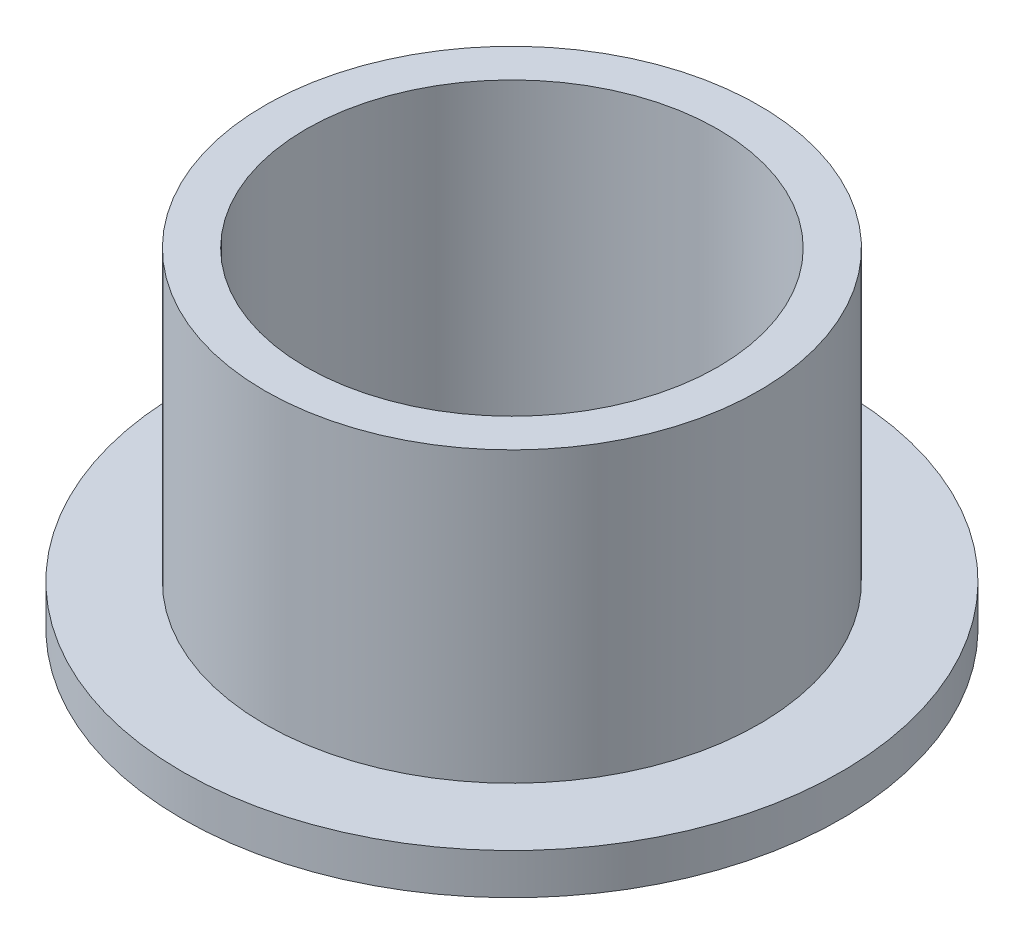
ISO-10303-21;
HEADER;
FILE_DESCRIPTION(('STEP AP214'),'2;1');
FILE_NAME('part.step','',(''),(''),'','','');
FILE_SCHEMA(('AUTOMOTIVE_DESIGN { 1 0 10303 214 1 1 1 1 }'));
ENDSEC;
DATA;
#1=APPLICATION_CONTEXT('core data for automotive mechanical design processes');
#2=APPLICATION_PROTOCOL_DEFINITION('international standard','automotive_design',2000,#1);
#3=PRODUCT_CONTEXT('',#1,'mechanical');
#4=PRODUCT('Part','Part','',(#3));
#5=PRODUCT_RELATED_PRODUCT_CATEGORY('part','',(#4));
#6=PRODUCT_DEFINITION_FORMATION('','',#4);
#7=PRODUCT_DEFINITION_CONTEXT('part definition',#1,'design');
#8=PRODUCT_DEFINITION('design','',#6,#7);
#9=PRODUCT_DEFINITION_SHAPE('','',#8);
#10=(LENGTH_UNIT() NAMED_UNIT(*) SI_UNIT(.MILLI.,.METRE.));
#11=(NAMED_UNIT(*) PLANE_ANGLE_UNIT() SI_UNIT($,.RADIAN.));
#12=(NAMED_UNIT(*) SI_UNIT($,.STERADIAN.) SOLID_ANGLE_UNIT());
#13=UNCERTAINTY_MEASURE_WITH_UNIT(LENGTH_MEASURE(1.E-05),#10,'distance_accuracy_value','');
#14=(GEOMETRIC_REPRESENTATION_CONTEXT(3) GLOBAL_UNCERTAINTY_ASSIGNED_CONTEXT((#13)) GLOBAL_UNIT_ASSIGNED_CONTEXT((#10,
#11,#12)) REPRESENTATION_CONTEXT('',''));
#15=CARTESIAN_POINT('',(0.,0.,0.));
#16=DIRECTION('',(0.,0.,1.));
#17=DIRECTION('',(1.,0.,0.));
#18=AXIS2_PLACEMENT_3D('',#15,#16,#17);
#19=CARTESIAN_POINT('',(0.,26.7127403846154,0.));
#20=DIRECTION('',(0.,1.,0.));
#21=DIRECTION('',(0.,0.,1.));
#22=AXIS2_PLACEMENT_3D('',#19,#20,#21);
#23=CYLINDRICAL_SURFACE('',#22,7.9375);
#24=CARTESIAN_POINT('',(0.,0.,0.));
#25=DIRECTION('',(0.,1.,0.));
#26=DIRECTION('',(0.,0.,1.));
#27=AXIS2_PLACEMENT_3D('',#24,#25,#26);
#28=CIRCLE('',#27,7.9375);
#29=CARTESIAN_POINT('',(0.,0.,7.9375));
#30=VERTEX_POINT('',#29);
#31=EDGE_CURVE('E10',#30,#30,#28,.T.);
#32=ORIENTED_EDGE('',*,*,#31,.F.);
#33=EDGE_LOOP('',(#32));
#34=FACE_BOUND('',#33,.T.);
#35=CARTESIAN_POINT('',(0.,12.7,0.));
#36=DIRECTION('',(0.,1.,0.));
#37=DIRECTION('',(0.,0.,1.));
#38=AXIS2_PLACEMENT_3D('',#35,#36,#37);
#39=CIRCLE('',#38,7.9375);
#40=CARTESIAN_POINT('',(0.,12.7,7.9375));
#41=VERTEX_POINT('',#40);
#42=EDGE_CURVE('E54',#41,#41,#39,.T.);
#43=ORIENTED_EDGE('',*,*,#42,.T.);
#44=EDGE_LOOP('',(#43));
#45=FACE_BOUND('',#44,.T.);
#46=ADVANCED_FACE('F32',(#34,#45),#23,.F.);
#47=CARTESIAN_POINT('',(7.9375,0.,0.));
#48=DIRECTION('',(0.,1.,0.));
#49=DIRECTION('',(0.,0.,1.));
#50=AXIS2_PLACEMENT_3D('',#47,#48,#49);
#51=PLANE('',#50);
#52=CARTESIAN_POINT('',(0.,0.,0.));
#53=DIRECTION('',(0.,1.,0.));
#54=DIRECTION('',(0.,0.,1.));
#55=AXIS2_PLACEMENT_3D('',#52,#53,#54);
#56=CIRCLE('',#55,12.7);
#57=CARTESIAN_POINT('',(0.,0.,12.7));
#58=VERTEX_POINT('',#57);
#59=EDGE_CURVE('E38',#58,#58,#56,.T.);
#60=ORIENTED_EDGE('',*,*,#59,.F.);
#61=EDGE_LOOP('',(#60));
#62=FACE_BOUND('',#61,.T.);
#63=ORIENTED_EDGE('',*,*,#31,.T.);
#64=EDGE_LOOP('',(#63));
#65=FACE_BOUND('',#64,.T.);
#66=ADVANCED_FACE('F79',(#62,#65),#51,.F.);
#67=CARTESIAN_POINT('',(0.,26.7127403846154,0.));
#68=DIRECTION('',(0.,1.,0.));
#69=DIRECTION('',(0.,0.,1.));
#70=AXIS2_PLACEMENT_3D('',#67,#68,#69);
#71=CYLINDRICAL_SURFACE('',#70,12.7);
#72=CARTESIAN_POINT('',(0.,1.5748,0.));
#73=DIRECTION('',(0.,1.,0.));
#74=DIRECTION('',(0.,0.,1.));
#75=AXIS2_PLACEMENT_3D('',#72,#73,#74);
#76=CIRCLE('',#75,12.7);
#77=CARTESIAN_POINT('',(0.,1.5748,12.7));
#78=VERTEX_POINT('',#77);
#79=EDGE_CURVE('E42',#78,#78,#76,.T.);
#80=ORIENTED_EDGE('',*,*,#79,.F.);
#81=EDGE_LOOP('',(#80));
#82=FACE_BOUND('',#81,.T.);
#83=ORIENTED_EDGE('',*,*,#59,.T.);
#84=EDGE_LOOP('',(#83));
#85=FACE_BOUND('',#84,.T.);
#86=ADVANCED_FACE('F74',(#82,#85),#71,.T.);
#87=CARTESIAN_POINT('',(12.7,1.5748,0.));
#88=DIRECTION('',(0.,-1.,0.));
#89=DIRECTION('',(0.,0.,-1.));
#90=AXIS2_PLACEMENT_3D('',#87,#88,#89);
#91=PLANE('',#90);
#92=CARTESIAN_POINT('',(0.,1.5748,0.));
#93=DIRECTION('',(0.,1.,0.));
#94=DIRECTION('',(0.,0.,1.));
#95=AXIS2_PLACEMENT_3D('',#92,#93,#94);
#96=CIRCLE('',#95,9.525);
#97=CARTESIAN_POINT('',(0.,1.5748,9.525));
#98=VERTEX_POINT('',#97);
#99=EDGE_CURVE('E46',#98,#98,#96,.T.);
#100=ORIENTED_EDGE('',*,*,#99,.F.);
#101=EDGE_LOOP('',(#100));
#102=FACE_BOUND('',#101,.T.);
#103=ORIENTED_EDGE('',*,*,#79,.T.);
#104=EDGE_LOOP('',(#103));
#105=FACE_BOUND('',#104,.T.);
#106=ADVANCED_FACE('F68',(#102,#105),#91,.F.);
#107=CARTESIAN_POINT('',(0.,26.7127403846154,0.));
#108=DIRECTION('',(0.,1.,0.));
#109=DIRECTION('',(0.,0.,1.));
#110=AXIS2_PLACEMENT_3D('',#107,#108,#109);
#111=CYLINDRICAL_SURFACE('',#110,9.525);
#112=CARTESIAN_POINT('',(0.,12.7,0.));
#113=DIRECTION('',(0.,1.,0.));
#114=DIRECTION('',(0.,0.,1.));
#115=AXIS2_PLACEMENT_3D('',#112,#113,#114);
#116=CIRCLE('',#115,9.525);
#117=CARTESIAN_POINT('',(0.,12.7,9.525));
#118=VERTEX_POINT('',#117);
#119=EDGE_CURVE('E51',#118,#118,#116,.T.);
#120=ORIENTED_EDGE('',*,*,#119,.F.);
#121=EDGE_LOOP('',(#120));
#122=FACE_BOUND('',#121,.T.);
#123=ORIENTED_EDGE('',*,*,#99,.T.);
#124=EDGE_LOOP('',(#123));
#125=FACE_BOUND('',#124,.T.);
#126=ADVANCED_FACE('F62',(#122,#125),#111,.T.);
#127=CARTESIAN_POINT('',(9.525,12.7,0.));
#128=DIRECTION('',(0.,-1.,0.));
#129=DIRECTION('',(0.,0.,-1.));
#130=AXIS2_PLACEMENT_3D('',#127,#128,#129);
#131=PLANE('',#130);
#132=ORIENTED_EDGE('',*,*,#42,.F.);
#133=EDGE_LOOP('',(#132));
#134=FACE_BOUND('',#133,.T.);
#135=ORIENTED_EDGE('',*,*,#119,.T.);
#136=EDGE_LOOP('',(#135));
#137=FACE_BOUND('',#136,.T.);
#138=ADVANCED_FACE('F59',(#134,#137),#131,.F.);
#139=CLOSED_SHELL('',(#46,#66,#86,#106,#126,#138));
#140=MANIFOLD_SOLID_BREP('B2',#139);
#141=ADVANCED_BREP_SHAPE_REPRESENTATION('',(#18,#140),#14);
#142=SHAPE_DEFINITION_REPRESENTATION(#9,#141);
ENDSEC;
END-ISO-10303-21;
